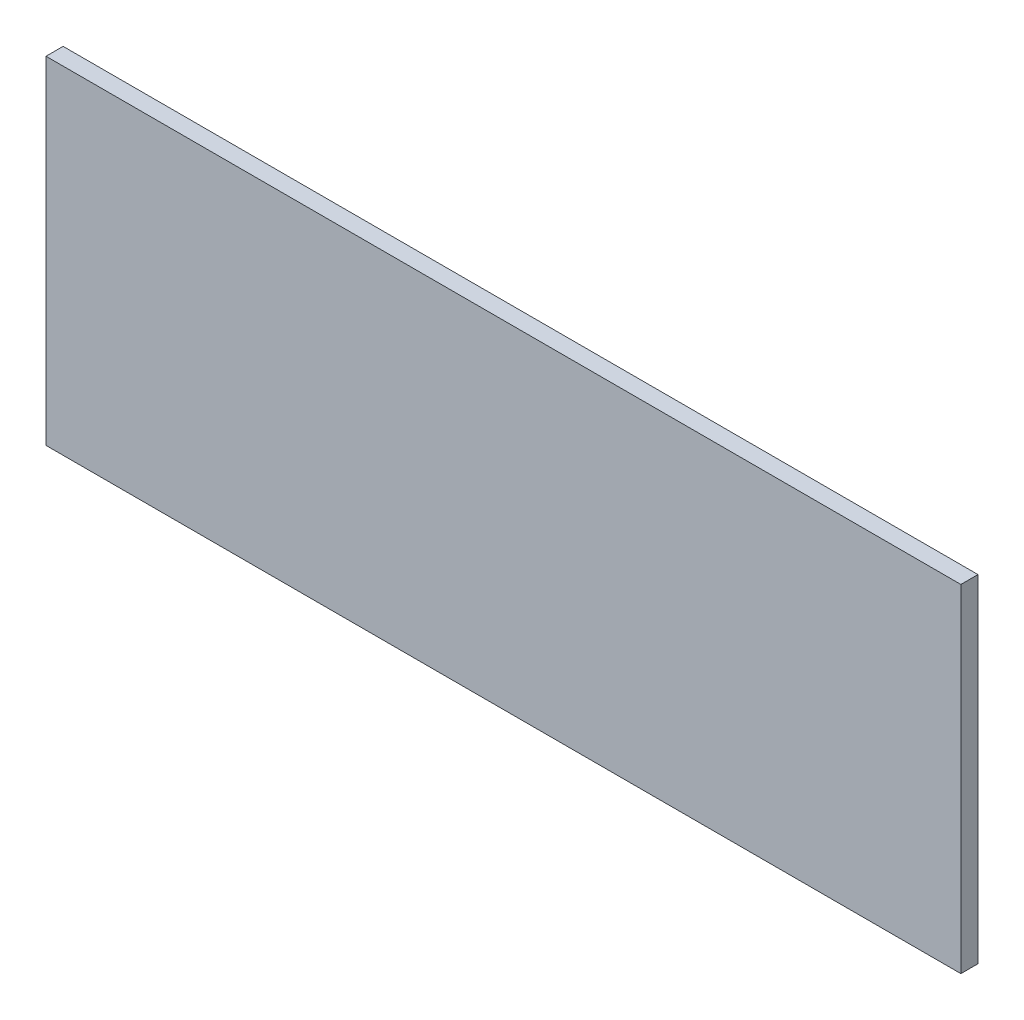
ISO-10303-21;
HEADER;
FILE_DESCRIPTION(('STEP AP214'),'2;1');
FILE_NAME('part.step','',(''),(''),'','','');
FILE_SCHEMA(('AUTOMOTIVE_DESIGN { 1 0 10303 214 1 1 1 1 }'));
ENDSEC;
DATA;
#1=APPLICATION_CONTEXT('core data for automotive mechanical design processes');
#2=APPLICATION_PROTOCOL_DEFINITION('international standard','automotive_design',2000,#1);
#3=PRODUCT_CONTEXT('',#1,'mechanical');
#4=PRODUCT('Part','Part','',(#3));
#5=PRODUCT_RELATED_PRODUCT_CATEGORY('part','',(#4));
#6=PRODUCT_DEFINITION_FORMATION('','',#4);
#7=PRODUCT_DEFINITION_CONTEXT('part definition',#1,'design');
#8=PRODUCT_DEFINITION('design','',#6,#7);
#9=PRODUCT_DEFINITION_SHAPE('','',#8);
#10=(LENGTH_UNIT() NAMED_UNIT(*) SI_UNIT(.MILLI.,.METRE.));
#11=(NAMED_UNIT(*) PLANE_ANGLE_UNIT() SI_UNIT($,.RADIAN.));
#12=(NAMED_UNIT(*) SI_UNIT($,.STERADIAN.) SOLID_ANGLE_UNIT());
#13=UNCERTAINTY_MEASURE_WITH_UNIT(LENGTH_MEASURE(1.E-05),#10,'distance_accuracy_value','');
#14=(GEOMETRIC_REPRESENTATION_CONTEXT(3) GLOBAL_UNCERTAINTY_ASSIGNED_CONTEXT((#13)) GLOBAL_UNIT_ASSIGNED_CONTEXT((#10,
#11,#12)) REPRESENTATION_CONTEXT('',''));
#15=CARTESIAN_POINT('',(0.,0.,0.));
#16=DIRECTION('',(0.,0.,1.));
#17=DIRECTION('',(1.,0.,0.));
#18=AXIS2_PLACEMENT_3D('',#15,#16,#17);
#19=CARTESIAN_POINT('',(81.8669967651367,68.8369979858399,0.));
#20=DIRECTION('',(0.,1.,0.));
#21=DIRECTION('',(1.,0.,0.));
#22=AXIS2_PLACEMENT_3D('',#19,#20,#21);
#23=PLANE('',#22);
#24=DIRECTION('',(1.,0.,0.));
#25=VECTOR('',#24,1.);
#26=CARTESIAN_POINT('',(81.8669967651367,68.8369979858398,0.03556));
#27=LINE('',#26,#25);
#28=CARTESIAN_POINT('',(81.8669967651367,68.8369979858398,0.03556));
#29=VERTEX_POINT('',#28);
#30=CARTESIAN_POINT('',(83.7669982910156,68.8369979858398,0.03556));
#31=VERTEX_POINT('',#30);
#32=EDGE_CURVE('E11',#29,#31,#27,.T.);
#33=ORIENTED_EDGE('',*,*,#32,.F.);
#34=DIRECTION('',(0.,0.,1.));
#35=VECTOR('',#34,1.);
#36=CARTESIAN_POINT('',(81.8669967651367,68.8369979858398,0.));
#37=LINE('',#36,#35);
#38=CARTESIAN_POINT('',(81.8669967651367,68.8369979858398,0.));
#39=VERTEX_POINT('',#38);
#40=EDGE_CURVE('E24',#39,#29,#37,.T.);
#41=ORIENTED_EDGE('',*,*,#40,.F.);
#42=DIRECTION('',(1.,0.,0.));
#43=VECTOR('',#42,1.);
#44=CARTESIAN_POINT('',(81.8669967651367,68.8369979858398,0.));
#45=LINE('',#44,#43);
#46=CARTESIAN_POINT('',(83.7669982910156,68.8369979858398,0.));
#47=VERTEX_POINT('',#46);
#48=EDGE_CURVE('E75',#39,#47,#45,.T.);
#49=ORIENTED_EDGE('',*,*,#48,.T.);
#50=DIRECTION('',(0.,0.,1.));
#51=VECTOR('',#50,1.);
#52=CARTESIAN_POINT('',(83.7669982910156,68.8369979858398,0.));
#53=LINE('',#52,#51);
#54=EDGE_CURVE('E37',#47,#31,#53,.T.);
#55=ORIENTED_EDGE('',*,*,#54,.T.);
#56=EDGE_LOOP('',(#33,#41,#49,#55));
#57=FACE_BOUND('',#56,.T.);
#58=ADVANCED_FACE('F17',(#57),#23,.F.);
#59=CARTESIAN_POINT('',(83.7669982910156,68.8369979858399,0.));
#60=DIRECTION('',(-1.,0.,0.));
#61=DIRECTION('',(0.,1.,0.));
#62=AXIS2_PLACEMENT_3D('',#59,#60,#61);
#63=PLANE('',#62);
#64=DIRECTION('',(0.,1.,0.));
#65=VECTOR('',#64,1.);
#66=CARTESIAN_POINT('',(83.7669982910156,68.8369979858398,0.03556));
#67=LINE('',#66,#65);
#68=CARTESIAN_POINT('',(83.7669982910156,69.5370025634766,0.03556));
#69=VERTEX_POINT('',#68);
#70=EDGE_CURVE('E83',#31,#69,#67,.T.);
#71=ORIENTED_EDGE('',*,*,#70,.F.);
#72=ORIENTED_EDGE('',*,*,#54,.F.);
#73=DIRECTION('',(0.,1.,0.));
#74=VECTOR('',#73,1.);
#75=CARTESIAN_POINT('',(83.7669982910156,68.8369979858398,0.));
#76=LINE('',#75,#74);
#77=CARTESIAN_POINT('',(83.7669982910156,69.5370025634766,0.));
#78=VERTEX_POINT('',#77);
#79=EDGE_CURVE('E81',#47,#78,#76,.T.);
#80=ORIENTED_EDGE('',*,*,#79,.T.);
#81=DIRECTION('',(0.,0.,1.));
#82=VECTOR('',#81,1.);
#83=CARTESIAN_POINT('',(83.7669982910156,69.5370025634766,0.));
#84=LINE('',#83,#82);
#85=EDGE_CURVE('E67',#78,#69,#84,.T.);
#86=ORIENTED_EDGE('',*,*,#85,.T.);
#87=EDGE_LOOP('',(#71,#72,#80,#86));
#88=FACE_BOUND('',#87,.T.);
#89=ADVANCED_FACE('F89',(#88),#63,.F.);
#90=CARTESIAN_POINT('',(83.7669982910156,69.5370025634766,0.));
#91=DIRECTION('',(0.,-1.,0.));
#92=DIRECTION('',(-1.,0.,0.));
#93=AXIS2_PLACEMENT_3D('',#90,#91,#92);
#94=PLANE('',#93);
#95=DIRECTION('',(-1.,0.,0.));
#96=VECTOR('',#95,1.);
#97=CARTESIAN_POINT('',(83.7669982910156,69.5370025634766,0.03556));
#98=LINE('',#97,#96);
#99=CARTESIAN_POINT('',(81.8669967651367,69.5370025634766,0.03556));
#100=VERTEX_POINT('',#99);
#101=EDGE_CURVE('E71',#69,#100,#98,.T.);
#102=ORIENTED_EDGE('',*,*,#101,.F.);
#103=ORIENTED_EDGE('',*,*,#85,.F.);
#104=DIRECTION('',(-1.,0.,0.));
#105=VECTOR('',#104,1.);
#106=CARTESIAN_POINT('',(83.7669982910156,69.5370025634766,0.));
#107=LINE('',#106,#105);
#108=CARTESIAN_POINT('',(81.8669967651367,69.5370025634766,0.));
#109=VERTEX_POINT('',#108);
#110=EDGE_CURVE('E63',#78,#109,#107,.T.);
#111=ORIENTED_EDGE('',*,*,#110,.T.);
#112=DIRECTION('',(0.,0.,1.));
#113=VECTOR('',#112,1.);
#114=CARTESIAN_POINT('',(81.8669967651367,69.5370025634766,0.));
#115=LINE('',#114,#113);
#116=EDGE_CURVE('E53',#109,#100,#115,.T.);
#117=ORIENTED_EDGE('',*,*,#116,.T.);
#118=EDGE_LOOP('',(#102,#103,#111,#117));
#119=FACE_BOUND('',#118,.T.);
#120=ADVANCED_FACE('F66',(#119),#94,.F.);
#121=CARTESIAN_POINT('',(81.8669967651367,69.5370025634766,0.));
#122=DIRECTION('',(1.,0.,0.));
#123=DIRECTION('',(0.,-1.,0.));
#124=AXIS2_PLACEMENT_3D('',#121,#122,#123);
#125=PLANE('',#124);
#126=DIRECTION('',(0.,-1.,0.));
#127=VECTOR('',#126,1.);
#128=CARTESIAN_POINT('',(81.8669967651367,69.5370025634766,0.03556));
#129=LINE('',#128,#127);
#130=EDGE_CURVE('E59',#100,#29,#129,.T.);
#131=ORIENTED_EDGE('',*,*,#130,.F.);
#132=ORIENTED_EDGE('',*,*,#116,.F.);
#133=DIRECTION('',(0.,-1.,0.));
#134=VECTOR('',#133,1.);
#135=CARTESIAN_POINT('',(81.8669967651367,69.5370025634766,0.));
#136=LINE('',#135,#134);
#137=EDGE_CURVE('E57',#109,#39,#136,.T.);
#138=ORIENTED_EDGE('',*,*,#137,.T.);
#139=ORIENTED_EDGE('',*,*,#40,.T.);
#140=EDGE_LOOP('',(#131,#132,#138,#139));
#141=FACE_BOUND('',#140,.T.);
#142=ADVANCED_FACE('F55',(#141),#125,.F.);
#143=CARTESIAN_POINT('',(81.8669967651367,68.8369979858399,0.));
#144=DIRECTION('',(0.,0.,-1.));
#145=DIRECTION('',(-1.,0.,0.));
#146=AXIS2_PLACEMENT_3D('',#143,#144,#145);
#147=PLANE('',#146);
#148=ORIENTED_EDGE('',*,*,#137,.F.);
#149=ORIENTED_EDGE('',*,*,#110,.F.);
#150=ORIENTED_EDGE('',*,*,#79,.F.);
#151=ORIENTED_EDGE('',*,*,#48,.F.);
#152=EDGE_LOOP('',(#148,#149,#150,#151));
#153=FACE_BOUND('',#152,.T.);
#154=ADVANCED_FACE('F74',(#153),#147,.T.);
#155=CARTESIAN_POINT('',(81.8669967651367,68.8369979858399,0.03556));
#156=DIRECTION('',(0.,0.,-1.));
#157=DIRECTION('',(-1.,0.,0.));
#158=AXIS2_PLACEMENT_3D('',#155,#156,#157);
#159=PLANE('',#158);
#160=ORIENTED_EDGE('',*,*,#32,.T.);
#161=ORIENTED_EDGE('',*,*,#70,.T.);
#162=ORIENTED_EDGE('',*,*,#101,.T.);
#163=ORIENTED_EDGE('',*,*,#130,.T.);
#164=EDGE_LOOP('',(#160,#161,#162,#163));
#165=FACE_BOUND('',#164,.T.);
#166=ADVANCED_FACE('F91',(#165),#159,.F.);
#167=CLOSED_SHELL('',(#58,#89,#120,#142,#154,#166));
#168=MANIFOLD_SOLID_BREP('B1',#167);
#169=ADVANCED_BREP_SHAPE_REPRESENTATION('',(#18,#168),#14);
#170=SHAPE_DEFINITION_REPRESENTATION(#9,#169);
ENDSEC;
END-ISO-10303-21;
